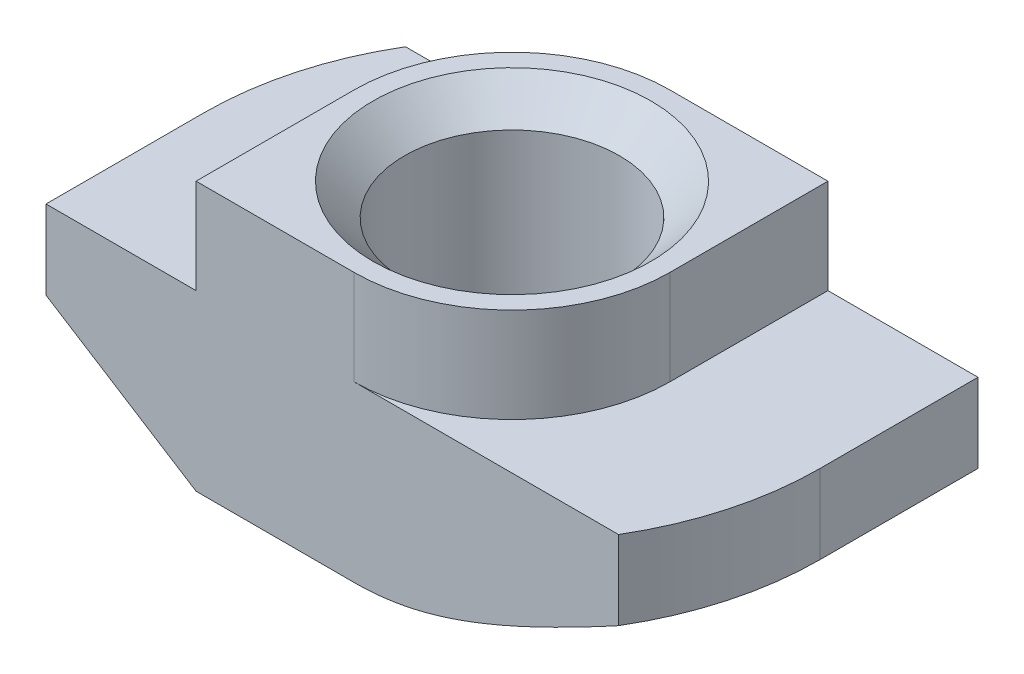
ISO-10303-21;
HEADER;
FILE_DESCRIPTION(('STEP AP214'),'2;1');
FILE_NAME('part.step','',(''),(''),'','','');
FILE_SCHEMA(('AUTOMOTIVE_DESIGN { 1 0 10303 214 1 1 1 1 }'));
ENDSEC;
DATA;
#1=APPLICATION_CONTEXT('core data for automotive mechanical design processes');
#2=APPLICATION_PROTOCOL_DEFINITION('international standard','automotive_design',2000,#1);
#3=PRODUCT_CONTEXT('',#1,'mechanical');
#4=PRODUCT('Part','Part','',(#3));
#5=PRODUCT_RELATED_PRODUCT_CATEGORY('part','',(#4));
#6=PRODUCT_DEFINITION_FORMATION('','',#4);
#7=PRODUCT_DEFINITION_CONTEXT('part definition',#1,'design');
#8=PRODUCT_DEFINITION('design','',#6,#7);
#9=PRODUCT_DEFINITION_SHAPE('','',#8);
#10=(LENGTH_UNIT() NAMED_UNIT(*) SI_UNIT(.MILLI.,.METRE.));
#11=(NAMED_UNIT(*) PLANE_ANGLE_UNIT() SI_UNIT($,.RADIAN.));
#12=(NAMED_UNIT(*) SI_UNIT($,.STERADIAN.) SOLID_ANGLE_UNIT());
#13=UNCERTAINTY_MEASURE_WITH_UNIT(LENGTH_MEASURE(1.E-05),#10,'distance_accuracy_value','');
#14=(GEOMETRIC_REPRESENTATION_CONTEXT(3) GLOBAL_UNCERTAINTY_ASSIGNED_CONTEXT((#13)) GLOBAL_UNIT_ASSIGNED_CONTEXT((#10,
#11,#12)) REPRESENTATION_CONTEXT('',''));
#15=CARTESIAN_POINT('',(0.,0.,0.));
#16=DIRECTION('',(0.,0.,1.));
#17=DIRECTION('',(1.,0.,0.));
#18=AXIS2_PLACEMENT_3D('',#15,#16,#17);
#19=CARTESIAN_POINT('',(-9.75,-3.,5.));
#20=DIRECTION('',(1.,0.,0.));
#21=DIRECTION('',(0.,1.,0.));
#22=AXIS2_PLACEMENT_3D('',#19,#20,#21);
#23=PLANE('',#22);
#24=DIRECTION('',(0.,0.,-1.));
#25=VECTOR('',#24,1.);
#26=CARTESIAN_POINT('',(-9.75,-5.5,5.));
#27=LINE('',#26,#25);
#28=CARTESIAN_POINT('',(-9.75,-5.5,5.));
#29=VERTEX_POINT('',#28);
#30=CARTESIAN_POINT('',(-9.75,-5.5,0.));
#31=VERTEX_POINT('',#30);
#32=EDGE_CURVE('E317',#29,#31,#27,.T.);
#33=ORIENTED_EDGE('',*,*,#32,.F.);
#34=DIRECTION('',(0.,-1.,0.));
#35=VECTOR('',#34,1.);
#36=CARTESIAN_POINT('',(-9.75,-3.,5.));
#37=LINE('',#36,#35);
#38=CARTESIAN_POINT('',(-9.75,-3.,5.));
#39=VERTEX_POINT('',#38);
#40=EDGE_CURVE('E163',#39,#29,#37,.T.);
#41=ORIENTED_EDGE('',*,*,#40,.F.);
#42=DIRECTION('',(0.,0.,-1.));
#43=VECTOR('',#42,1.);
#44=CARTESIAN_POINT('',(-9.75,-3.,5.));
#45=LINE('',#44,#43);
#46=CARTESIAN_POINT('',(-9.75,-3.,0.));
#47=VERTEX_POINT('',#46);
#48=EDGE_CURVE('E45',#39,#47,#45,.T.);
#49=ORIENTED_EDGE('',*,*,#48,.T.);
#50=DIRECTION('',(0.,1.,0.));
#51=VECTOR('',#50,1.);
#52=CARTESIAN_POINT('',(-9.75,-8.5,0.));
#53=LINE('',#52,#51);
#54=EDGE_CURVE('E209',#31,#47,#53,.T.);
#55=ORIENTED_EDGE('',*,*,#54,.F.);
#56=EDGE_LOOP('',(#33,#41,#49,#55));
#57=FACE_BOUND('',#56,.T.);
#58=ADVANCED_FACE('F37',(#57),#23,.F.);
#59=CARTESIAN_POINT('',(-9.75,-8.5,5.));
#60=DIRECTION('',(0.,1.,0.));
#61=DIRECTION('',(0.,0.,1.));
#62=AXIS2_PLACEMENT_3D('',#59,#60,#61);
#63=PLANE('',#62);
#64=CARTESIAN_POINT('',(0.,-8.5,0.));
#65=DIRECTION('',(0.,1.,0.));
#66=DIRECTION('',(0.,0.,1.));
#67=AXIS2_PLACEMENT_3D('',#64,#65,#66);
#68=CIRCLE('',#67,4.4);
#69=CARTESIAN_POINT('',(0.,-8.5,4.4));
#70=VERTEX_POINT('',#69);
#71=EDGE_CURVE('E258',#70,#70,#68,.T.);
#72=ORIENTED_EDGE('',*,*,#71,.T.);
#73=EDGE_LOOP('',(#72));
#74=FACE_BOUND('',#73,.T.);
#75=DIRECTION('',(1.,0.,0.));
#76=VECTOR('',#75,1.);
#77=CARTESIAN_POINT('',(-9.75,-8.5,5.));
#78=LINE('',#77,#76);
#79=CARTESIAN_POINT('',(-5.,-8.5,5.));
#80=VERTEX_POINT('',#79);
#81=CARTESIAN_POINT('',(0.,-8.5,5.));
#82=VERTEX_POINT('',#81);
#83=EDGE_CURVE('E161',#80,#82,#78,.T.);
#84=ORIENTED_EDGE('',*,*,#83,.F.);
#85=DIRECTION('',(0.,0.,-1.));
#86=VECTOR('',#85,1.);
#87=CARTESIAN_POINT('',(-5.,-8.5,5.));
#88=LINE('',#87,#86);
#89=CARTESIAN_POINT('',(-5.,-8.5,0.));
#90=VERTEX_POINT('',#89);
#91=EDGE_CURVE('E146',#80,#90,#88,.T.);
#92=ORIENTED_EDGE('',*,*,#91,.T.);
#93=CARTESIAN_POINT('',(0.,-8.5,0.));
#94=DIRECTION('',(0.,-1.,0.));
#95=DIRECTION('',(-1.,0.,0.));
#96=AXIS2_PLACEMENT_3D('',#93,#94,#95);
#97=CIRCLE('',#96,5.);
#98=CARTESIAN_POINT('',(0.,-8.5,-5.));
#99=VERTEX_POINT('',#98);
#100=EDGE_CURVE('E318',#90,#99,#97,.T.);
#101=ORIENTED_EDGE('',*,*,#100,.T.);
#102=DIRECTION('',(1.,0.,0.));
#103=VECTOR('',#102,1.);
#104=CARTESIAN_POINT('',(-9.75,-8.5,-5.));
#105=LINE('',#104,#103);
#106=CARTESIAN_POINT('',(5.,-8.5,-5.));
#107=VERTEX_POINT('',#106);
#108=EDGE_CURVE('E181',#99,#107,#105,.T.);
#109=ORIENTED_EDGE('',*,*,#108,.T.);
#110=DIRECTION('',(0.,0.,1.));
#111=VECTOR('',#110,1.);
#112=CARTESIAN_POINT('',(5.,-8.5,-9.75));
#113=LINE('',#112,#111);
#114=CARTESIAN_POINT('',(5.,-8.5,0.));
#115=VERTEX_POINT('',#114);
#116=EDGE_CURVE('E52',#107,#115,#113,.T.);
#117=ORIENTED_EDGE('',*,*,#116,.T.);
#118=CARTESIAN_POINT('',(0.,-8.5,0.));
#119=DIRECTION('',(0.,-1.,0.));
#120=DIRECTION('',(1.,0.,0.));
#121=AXIS2_PLACEMENT_3D('',#118,#119,#120);
#122=CIRCLE('',#121,5.);
#123=EDGE_CURVE('E167',#115,#82,#122,.T.);
#124=ORIENTED_EDGE('',*,*,#123,.T.);
#125=EDGE_LOOP('',(#84,#92,#101,#109,#117,#124));
#126=FACE_BOUND('',#125,.T.);
#127=ADVANCED_FACE('F166',(#74,#126),#63,.F.);
#128=CARTESIAN_POINT('',(9.75,-3.,5.));
#129=DIRECTION('',(-1.,0.,0.));
#130=DIRECTION('',(0.,-1.,0.));
#131=AXIS2_PLACEMENT_3D('',#128,#129,#130);
#132=PLANE('',#131);
#133=DIRECTION('',(0.,0.,1.));
#134=VECTOR('',#133,1.);
#135=CARTESIAN_POINT('',(9.75,-5.5,-9.75));
#136=LINE('',#135,#134);
#137=CARTESIAN_POINT('',(9.75,-5.5,-5.));
#138=VERTEX_POINT('',#137);
#139=CARTESIAN_POINT('',(9.75,-5.5,0.));
#140=VERTEX_POINT('',#139);
#141=EDGE_CURVE('E305',#138,#140,#136,.T.);
#142=ORIENTED_EDGE('',*,*,#141,.F.);
#143=DIRECTION('',(0.,1.,0.));
#144=VECTOR('',#143,1.);
#145=CARTESIAN_POINT('',(9.75,-3.,-5.));
#146=LINE('',#145,#144);
#147=CARTESIAN_POINT('',(9.75,-3.,-5.));
#148=VERTEX_POINT('',#147);
#149=EDGE_CURVE('E185',#138,#148,#146,.T.);
#150=ORIENTED_EDGE('',*,*,#149,.T.);
#151=DIRECTION('',(0.,0.,-1.));
#152=VECTOR('',#151,1.);
#153=CARTESIAN_POINT('',(9.75,-3.,5.));
#154=LINE('',#153,#152);
#155=CARTESIAN_POINT('',(9.75,-3.,0.));
#156=VERTEX_POINT('',#155);
#157=EDGE_CURVE('E203',#156,#148,#154,.T.);
#158=ORIENTED_EDGE('',*,*,#157,.F.);
#159=DIRECTION('',(0.,1.,0.));
#160=VECTOR('',#159,1.);
#161=CARTESIAN_POINT('',(9.75,-8.5,0.));
#162=LINE('',#161,#160);
#163=EDGE_CURVE('E220',#140,#156,#162,.T.);
#164=ORIENTED_EDGE('',*,*,#163,.F.);
#165=EDGE_LOOP('',(#142,#150,#158,#164));
#166=FACE_BOUND('',#165,.T.);
#167=ADVANCED_FACE('F304',(#166),#132,.F.);
#168=CARTESIAN_POINT('',(0.,0.,5.));
#169=DIRECTION('',(0.,0.,-1.));
#170=DIRECTION('',(-1.,0.,0.));
#171=AXIS2_PLACEMENT_3D('',#168,#169,#170);
#172=PLANE('',#171);
#173=DIRECTION('',(-0.845488903030971,0.533992991387982,0.));
#174=VECTOR('',#173,1.);
#175=CARTESIAN_POINT('',(-5.,-8.5,5.));
#176=LINE('',#175,#174);
#177=EDGE_CURVE('E149',#80,#29,#176,.T.);
#178=ORIENTED_EDGE('',*,*,#177,.F.);
#179=ORIENTED_EDGE('',*,*,#83,.T.);
#180=CARTESIAN_POINT('',(17.262244143281,-0.307293389432442,5.));
#181=CARTESIAN_POINT('',(16.9181308600236,-0.516038873305145,5.));
#182=CARTESIAN_POINT('',(16.5738102897848,-0.724443579056905,5.));
#183=CARTESIAN_POINT('',(15.8846572648478,-1.14040949764273,5.));
#184=CARTESIAN_POINT('',(15.5398248070583,-1.34797070535434,5.));
#185=CARTESIAN_POINT('',(14.849449183752,-1.76214855860734,5.));
#186=CARTESIAN_POINT('',(14.5039058329425,-1.96876489545256,5.));
#187=CARTESIAN_POINT('',(13.8120865339308,-2.38076637630233,5.));
#188=CARTESIAN_POINT('',(13.4658105873009,-2.58615152294555,5.));
#189=CARTESIAN_POINT('',(12.7701257444387,-2.9967235767826,5.));
#190=CARTESIAN_POINT('',(12.4207110467127,-3.20190066061248,5.));
#191=CARTESIAN_POINT('',(11.7207559725619,-3.61032570435187,5.));
#192=CARTESIAN_POINT('',(11.3702155989535,-3.81357366908299,5.));
#193=CARTESIAN_POINT('',(10.6677796822931,-4.21757158257786,5.));
#194=CARTESIAN_POINT('',(10.3158843909765,-4.41832196857919,5.));
#195=CARTESIAN_POINT('',(9.61028766235045,-4.81662297884814,5.));
#196=CARTESIAN_POINT('',(9.25658624442202,-5.01417363735639,5.));
#197=CARTESIAN_POINT('',(8.67651884482225,-5.33358875947317,5.));
#198=CARTESIAN_POINT('',(8.45085586286926,-5.45672933011883,5.));
#199=CARTESIAN_POINT('',(7.99839816596211,-5.7009118245922,5.));
#200=CARTESIAN_POINT('',(7.7716034613976,-5.82195376764063,5.));
#201=CARTESIAN_POINT('',(7.31656550307167,-6.06150930978857,5.));
#202=CARTESIAN_POINT('',(7.08832171147009,-6.18002188913812,5.));
#203=CARTESIAN_POINT('',(6.63019586788231,-6.4138387855286,5.));
#204=CARTESIAN_POINT('',(6.40031383435597,-6.52914313864854,5.));
#205=CARTESIAN_POINT('',(5.93820478281431,-6.75588727170323,5.));
#206=CARTESIAN_POINT('',(5.7059746936284,-6.86732081363046,5.));
#207=CARTESIAN_POINT('',(5.23907645564551,-7.08502278555658,5.));
#208=CARTESIAN_POINT('',(5.00440814785845,-7.19129087613112,5.));
#209=CARTESIAN_POINT('',(4.53226065346344,-7.39709096715067,5.));
#210=CARTESIAN_POINT('',(4.29478297028451,-7.49662639457186,5.));
#211=CARTESIAN_POINT('',(3.81637192229998,-7.68696585333208,5.));
#212=CARTESIAN_POINT('',(3.5754391700731,-7.77777141099744,5.));
#213=CARTESIAN_POINT('',(3.0666504277393,-7.95599282874955,5.));
#214=CARTESIAN_POINT('',(2.79839541579213,-8.04228449542548,5.));
#215=CARTESIAN_POINT('',(2.2565574894892,-8.19664810960895,5.));
#216=CARTESIAN_POINT('',(1.98297506296302,-8.26472171700009,5.));
#217=CARTESIAN_POINT('',(1.57048018943482,-8.34889725118016,5.));
#218=CARTESIAN_POINT('',(1.43336340824762,-8.37388041638201,5.));
#219=CARTESIAN_POINT('',(1.15813012493196,-8.41748641658561,5.));
#220=CARTESIAN_POINT('',(1.02001377745311,-8.436110214877,5.));
#221=CARTESIAN_POINT('',(0.743060652147379,-8.46647997898083,5.));
#222=CARTESIAN_POINT('',(0.604224087141818,-8.47822787147193,5.));
#223=CARTESIAN_POINT('',(0.326124948003932,-8.49449788273713,5.));
#224=CARTESIAN_POINT('',(0.186862377229114,-8.4990200583135,5.));
#225=CARTESIAN_POINT('',(-0.0922407847681702,-8.50069722270995,5.));
#226=CARTESIAN_POINT('',(-0.232081548334554,-8.49782394939686,5.));
#227=CARTESIAN_POINT('',(-0.511416983097128,-8.48474358023713,5.));
#228=CARTESIAN_POINT('',(-0.650911651522947,-8.47453642587413,5.));
#229=CARTESIAN_POINT('',(-0.929240782372286,-8.44710081868491,5.));
#230=CARTESIAN_POINT('',(-1.06807506182894,-8.42987052298589,5.));
#231=CARTESIAN_POINT('',(-1.34478468003669,-8.38888095808797,5.));
#232=CARTESIAN_POINT('',(-1.48265986658218,-8.36512067578682,5.));
#233=CARTESIAN_POINT('',(-1.89959043169188,-8.28395489226572,5.));
#234=CARTESIAN_POINT('',(-2.17684565694345,-8.21720360210331,5.));
#235=CARTESIAN_POINT('',(-2.72589170638494,-8.06457588389501,5.));
#236=CARTESIAN_POINT('',(-2.99768197912353,-7.97869753625189,5.));
#237=CARTESIAN_POINT('',(-3.51935741319823,-7.79847300649859,5.));
#238=CARTESIAN_POINT('',(-3.76954704201942,-7.70499615425147,5.));
#239=CARTESIAN_POINT('',(-4.26618103118316,-7.50852092270228,5.));
#240=CARTESIAN_POINT('',(-4.51262461455279,-7.40552059867213,5.));
#241=CARTESIAN_POINT('',(-5.00262192827966,-7.19219327582968,5.));
#242=CARTESIAN_POINT('',(-5.24617216747364,-7.08185831308792,5.));
#243=CARTESIAN_POINT('',(-5.73065462411407,-6.85565949095677,5.));
#244=CARTESIAN_POINT('',(-5.97158705304315,-6.73979608232788,5.));
#245=CARTESIAN_POINT('',(-6.43818954732616,-6.5102320811199,5.));
#246=CARTESIAN_POINT('',(-6.66397276848694,-6.39676061738702,5.));
#247=CARTESIAN_POINT('',(-7.11397427522263,-6.16674600104322,5.));
#248=CARTESIAN_POINT('',(-7.33819251414361,-6.05020275734948,5.));
#249=CARTESIAN_POINT('',(-7.78462128962769,-5.81501515861086,5.));
#250=CARTESIAN_POINT('',(-8.00683592168321,-5.69637855963136,5.));
#251=CARTESIAN_POINT('',(-8.45015187326331,-5.45708859393409,5.));
#252=CARTESIAN_POINT('',(-8.67125329033443,-5.3364354080695,5.));
#253=CARTESIAN_POINT('',(-8.89190962188937,-5.21498281447114,5.));
#254=B_SPLINE_CURVE_WITH_KNOTS('',3,(#180,#181,#182,#183,#184,#185,#186,#187,#188,#189,#190,
#191,#192,#193,#194,#195,#196,#197,#198,#199,#200,#201,#202,#203,#204,#205,#206,#207,#208,#209,
#210,#211,#212,#213,#214,#215,#216,#217,#218,#219,#220,#221,#222,#223,#224,#225,#226,#227,#228,
#229,#230,#231,#232,#233,#234,#235,#236,#237,#238,#239,#240,#241,#242,#243,#244,#245,#246,#247,
#248,#249,#250,#251,#252,#253),.UNSPECIFIED.,.F.,.F.,(4,2,2,2,2,2,2,2,2,2,2,2,2,2,2,2,2,2,2,2,2,
2,2,2,2,2,2,2,2,2,2,2,2,2,2,2,4),(0.,1.2074348525902,2.41487702685636,3.6226889318846,
4.83049824742936,6.04609801107066,7.26169473565424,8.47707556989018,9.6924433896013,
10.4636587366001,11.2348670165302,12.0063805610561,12.7778854258001,13.5505808046002,
14.3233268891437,15.0956766332549,15.8678910935751,16.712814547319,17.5576609921784,
17.9756593894318,18.3935944419621,18.8114123299238,19.2292269333493,19.6486406079805,
20.0680576291127,20.4875847762243,20.9071770481351,21.7617047407382,22.6163182326723,
23.4173126374625,24.2184709710381,25.0205138758327,25.8224914976274,26.5805429248652,
27.3386168547938,28.0943078892628,28.8499315110688),.UNSPECIFIED.);
#255=CARTESIAN_POINT('',(8.3703345213916,-5.5,5.));
#256=VERTEX_POINT('',#255);
#257=EDGE_CURVE('E322',#256,#82,#254,.T.);
#258=ORIENTED_EDGE('',*,*,#257,.F.);
#259=DIRECTION('',(0.,1.,0.));
#260=VECTOR('',#259,1.);
#261=CARTESIAN_POINT('',(8.37033452139161,-8.5,5.));
#262=LINE('',#261,#260);
#263=CARTESIAN_POINT('',(8.37033452139161,-3.,5.));
#264=VERTEX_POINT('',#263);
#265=EDGE_CURVE('E223',#256,#264,#262,.T.);
#266=ORIENTED_EDGE('',*,*,#265,.T.);
#267=DIRECTION('',(-1.,0.,0.));
#268=VECTOR('',#267,1.);
#269=CARTESIAN_POINT('',(5.,-3.,5.));
#270=LINE('',#269,#268);
#271=CARTESIAN_POINT('',(0.,-3.,5.));
#272=VERTEX_POINT('',#271);
#273=EDGE_CURVE('E168',#264,#272,#270,.T.);
#274=ORIENTED_EDGE('',*,*,#273,.T.);
#275=DIRECTION('',(0.,1.,0.));
#276=VECTOR('',#275,1.);
#277=CARTESIAN_POINT('',(0.,-10.0710678118655,5.));
#278=LINE('',#277,#276);
#279=CARTESIAN_POINT('',(0.,0.,5.));
#280=VERTEX_POINT('',#279);
#281=EDGE_CURVE('E246',#272,#280,#278,.T.);
#282=ORIENTED_EDGE('',*,*,#281,.T.);
#283=DIRECTION('',(-1.,0.,0.));
#284=VECTOR('',#283,1.);
#285=CARTESIAN_POINT('',(5.,0.,5.));
#286=LINE('',#285,#284);
#287=CARTESIAN_POINT('',(-5.,0.,5.));
#288=VERTEX_POINT('',#287);
#289=EDGE_CURVE('E170',#280,#288,#286,.T.);
#290=ORIENTED_EDGE('',*,*,#289,.T.);
#291=DIRECTION('',(0.,-1.,0.));
#292=VECTOR('',#291,1.);
#293=CARTESIAN_POINT('',(-5.,0.,5.));
#294=LINE('',#293,#292);
#295=CARTESIAN_POINT('',(-5.,-3.,5.));
#296=VERTEX_POINT('',#295);
#297=EDGE_CURVE('E196',#288,#296,#294,.T.);
#298=ORIENTED_EDGE('',*,*,#297,.T.);
#299=DIRECTION('',(-1.,0.,0.));
#300=VECTOR('',#299,1.);
#301=CARTESIAN_POINT('',(-5.,-3.,5.));
#302=LINE('',#301,#300);
#303=EDGE_CURVE('E172',#296,#39,#302,.T.);
#304=ORIENTED_EDGE('',*,*,#303,.T.);
#305=ORIENTED_EDGE('',*,*,#40,.T.);
#306=EDGE_LOOP('',(#178,#179,#258,#266,#274,#282,#290,#298,#304,#305));
#307=FACE_BOUND('',#306,.T.);
#308=ADVANCED_FACE('F159',(#307),#172,.F.);
#309=CARTESIAN_POINT('',(0.,0.,-5.));
#310=DIRECTION('',(0.,0.,-1.));
#311=DIRECTION('',(-1.,0.,0.));
#312=AXIS2_PLACEMENT_3D('',#309,#310,#311);
#313=PLANE('',#312);
#314=ORIENTED_EDGE('',*,*,#108,.F.);
#315=CARTESIAN_POINT('',(8.89190962188937,-5.21498281447114,-5.));
#316=CARTESIAN_POINT('',(8.69807179539359,-5.32168067117576,-5.));
#317=CARTESIAN_POINT('',(8.50388785728022,-5.42775496118508,-5.));
#318=CARTESIAN_POINT('',(8.1146877622672,-5.63838122911741,-5.));
#319=CARTESIAN_POINT('',(7.91967157637704,-5.7429331534413,-5.));
#320=CARTESIAN_POINT('',(7.52839888713611,-5.95038133144811,-5.));
#321=CARTESIAN_POINT('',(7.33214100146388,-6.05327498229202,-5.));
#322=CARTESIAN_POINT('',(6.93849540288173,-6.25688093934329,-5.));
#323=CARTESIAN_POINT('',(6.74110769028751,-6.3575932461601,-5.));
#324=CARTESIAN_POINT('',(6.3357672159849,-6.56100584407135,-5.));
#325=CARTESIAN_POINT('',(6.12775094383909,-6.66357990091405,-5.));
#326=CARTESIAN_POINT('',(5.70998529557087,-6.86514027333031,-5.));
#327=CARTESIAN_POINT('',(5.50023593777036,-6.96412662677306,-5.));
#328=CARTESIAN_POINT('',(5.07876792598832,-7.15757127235479,-5.));
#329=CARTESIAN_POINT('',(4.86705023469105,-7.25203165193533,-5.));
#330=CARTESIAN_POINT('',(4.44118238119509,-7.43528919122207,-5.));
#331=CARTESIAN_POINT('',(4.22703233985032,-7.52408663085993,-5.));
#332=CARTESIAN_POINT('',(3.74385288468483,-7.71506163103555,-5.));
#333=CARTESIAN_POINT('',(3.47404603839998,-7.81530000006557,-5.));
#334=CARTESIAN_POINT('',(2.92922404134082,-8.00085532819617,-5.));
#335=CARTESIAN_POINT('',(2.6542079386462,-8.08616953037964,-5.));
#336=CARTESIAN_POINT('',(2.10323036092006,-8.2355227100339,-5.));
#337=CARTESIAN_POINT('',(1.82736219174236,-8.29989467604697,-5.));
#338=CARTESIAN_POINT('',(1.4101978310497,-8.37787726350092,-5.));
#339=CARTESIAN_POINT('',(1.27061787891269,-8.40077217403349,-5.));
#340=CARTESIAN_POINT('',(0.990522379503271,-8.43978497345868,-5.));
#341=CARTESIAN_POINT('',(0.850006980711086,-8.45590391299746,-5.));
#342=CARTESIAN_POINT('',(0.565328569476554,-8.48115186670237,-5.));
#343=CARTESIAN_POINT('',(0.421151583542625,-8.49012478020239,-5.));
#344=CARTESIAN_POINT('',(0.132539112730267,-8.50020136367205,-5.));
#345=CARTESIAN_POINT('',(-0.0118963351057367,-8.50130608305248,-5.));
#346=CARTESIAN_POINT('',(-0.300615839300795,-8.49561054776519,-5.));
#347=CARTESIAN_POINT('',(-0.444899888884881,-8.48880995327448,-5.));
#348=CARTESIAN_POINT('',(-0.732898629950691,-8.46753431331152,-5.));
#349=CARTESIAN_POINT('',(-0.876613307528637,-8.45305908157811,-5.));
#350=CARTESIAN_POINT('',(-1.16451937665646,-8.41671855383272,-5.));
#351=CARTESIAN_POINT('',(-1.30870177468433,-8.39478264310604,-5.));
#352=CARTESIAN_POINT('',(-1.59588471177897,-8.34419166821339,-5.));
#353=CARTESIAN_POINT('',(-1.73888515141359,-8.31553604458982,-5.));
#354=CARTESIAN_POINT('',(-2.02358463369644,-8.25221795864572,-5.));
#355=CARTESIAN_POINT('',(-2.16528327980946,-8.21755372603012,-5.));
#356=CARTESIAN_POINT('',(-2.44727277130383,-8.14295776240236,-5.));
#357=CARTESIAN_POINT('',(-2.58756365220683,-8.10302616466134,-5.));
#358=CARTESIAN_POINT('',(-2.927338724847,-8.0002726410662,-5.));
#359=CARTESIAN_POINT('',(-3.12609221591402,-7.93503691060338,-5.));
#360=CARTESIAN_POINT('',(-3.52096210701494,-7.79698222477459,-5.));
#361=CARTESIAN_POINT('',(-3.71707797307315,-7.72416175924735,-5.));
#362=CARTESIAN_POINT('',(-4.10708618196062,-7.57237690861237,-5.));
#363=CARTESIAN_POINT('',(-4.3009766096039,-7.49340762920191,-5.));
#364=CARTESIAN_POINT('',(-4.6866661338769,-7.33057513990394,-5.));
#365=CARTESIAN_POINT('',(-4.87846536352017,-7.24671224346253,-5.));
#366=CARTESIAN_POINT('',(-5.2607772593493,-7.07480224612794,-5.));
#367=CARTESIAN_POINT('',(-5.4512852403128,-6.98674476181852,-5.));
#368=CARTESIAN_POINT('',(-5.83076905474579,-6.80738201092531,-5.));
#369=CARTESIAN_POINT('',(-6.01974483535833,-6.71607663287805,-5.));
#370=CARTESIAN_POINT('',(-6.58454713908627,-6.43827749032946,-5.));
#371=CARTESIAN_POINT('',(-6.95842335536811,-6.24782078764797,-5.));
#372=CARTESIAN_POINT('',(-7.70515742488139,-5.85818779711648,-5.));
#373=CARTESIAN_POINT('',(-8.07798641398966,-5.65895665273319,-5.));
#374=CARTESIAN_POINT('',(-8.82080321981212,-5.2552033688582,-5.));
#375=CARTESIAN_POINT('',(-9.19079078800562,-5.05068077324098,-5.));
#376=CARTESIAN_POINT('',(-9.92800640083409,-4.63809357113866,-5.));
#377=CARTESIAN_POINT('',(-10.29523790102,-4.43003512218061,-5.));
#378=CARTESIAN_POINT('',(-11.0280229788243,-4.01101145190697,-5.));
#379=CARTESIAN_POINT('',(-11.3935766017493,-3.80004630970179,-5.));
#380=CARTESIAN_POINT('',(-12.2228494781368,-3.31806355804453,-5.));
#381=CARTESIAN_POINT('',(-12.6861650743858,-3.04635210462268,-5.));
#382=CARTESIAN_POINT('',(-13.6114053897672,-2.50014341269301,-5.));
#383=CARTESIAN_POINT('',(-14.0733294596121,-2.22564507603178,-5.));
#384=CARTESIAN_POINT('',(-14.9903643529218,-1.67796879648898,-5.));
#385=CARTESIAN_POINT('',(-15.4454897918055,-1.40481530279485,-5.));
#386=CARTESIAN_POINT('',(-16.3546077462169,-0.857062812640609,-5.));
#387=CARTESIAN_POINT('',(-16.8086006597524,-0.582464476988671,-5.));
#388=CARTESIAN_POINT('',(-17.262244143281,-0.307293389432445,-5.));
#389=B_SPLINE_CURVE_WITH_KNOTS('',3,(#315,#316,#317,#318,#319,#320,#321,#322,#323,#324,#325,
#326,#327,#328,#329,#330,#331,#332,#333,#334,#335,#336,#337,#338,#339,#340,#341,#342,#343,#344,
#345,#346,#347,#348,#349,#350,#351,#352,#353,#354,#355,#356,#357,#358,#359,#360,#361,#362,#363,
#364,#365,#366,#367,#368,#369,#370,#371,#372,#373,#374,#375,#376,#377,#378,#379,#380,#381,#382,
#383,#384,#385,#386,#387,#388),.UNSPECIFIED.,.F.,.F.,(4,2,2,2,2,2,2,2,2,2,2,2,2,2,2,2,2,2,2,2,2,
2,2,2,2,2,2,2,2,2,2,2,2,2,2,2,4),(0.,0.663793087551966,1.32760948954786,1.99238242300439,
2.65715517073158,3.35292173371489,4.04868095055264,4.74411612233015,5.43951689051758,
6.30265939462683,7.16596117765935,8.01477619153837,8.43897242720581,8.86310286497019,
9.29626188046449,9.72936312282145,10.1624829834396,10.5956133562287,11.0329629501478,
11.4703489690564,11.9078640731688,12.3453681097069,12.9727207083369,13.6001984558662,
14.2281808687188,14.8561231020818,15.4857099520211,16.115318429447,17.3739591861229,
18.6420768889435,19.9103042707088,21.1765125465911,22.4426864283525,24.054007297902,
25.665989850327,27.2583959045239,28.8501279099315),.UNSPECIFIED.);
#390=CARTESIAN_POINT('',(-8.3703345213916,-5.5,-5.));
#391=VERTEX_POINT('',#390);
#392=EDGE_CURVE('E227',#99,#391,#389,.T.);
#393=ORIENTED_EDGE('',*,*,#392,.T.);
#394=DIRECTION('',(0.,1.,0.));
#395=VECTOR('',#394,1.);
#396=CARTESIAN_POINT('',(-8.3703345213916,-8.5,-5.));
#397=LINE('',#396,#395);
#398=CARTESIAN_POINT('',(-8.3703345213916,-3.,-5.));
#399=VERTEX_POINT('',#398);
#400=EDGE_CURVE('E219',#391,#399,#397,.T.);
#401=ORIENTED_EDGE('',*,*,#400,.T.);
#402=DIRECTION('',(-1.,0.,0.));
#403=VECTOR('',#402,1.);
#404=CARTESIAN_POINT('',(-5.,-3.,-5.));
#405=LINE('',#404,#403);
#406=CARTESIAN_POINT('',(0.,-3.,-5.));
#407=VERTEX_POINT('',#406);
#408=EDGE_CURVE('E178',#407,#399,#405,.T.);
#409=ORIENTED_EDGE('',*,*,#408,.F.);
#410=DIRECTION('',(0.,1.,0.));
#411=VECTOR('',#410,1.);
#412=CARTESIAN_POINT('',(0.,-10.0710678118655,-5.));
#413=LINE('',#412,#411);
#414=CARTESIAN_POINT('',(0.,0.,-5.));
#415=VERTEX_POINT('',#414);
#416=EDGE_CURVE('E255',#407,#415,#413,.T.);
#417=ORIENTED_EDGE('',*,*,#416,.T.);
#418=DIRECTION('',(-1.,0.,0.));
#419=VECTOR('',#418,1.);
#420=CARTESIAN_POINT('',(5.,0.,-5.));
#421=LINE('',#420,#419);
#422=CARTESIAN_POINT('',(5.,0.,-5.));
#423=VERTEX_POINT('',#422);
#424=EDGE_CURVE('E193',#423,#415,#421,.T.);
#425=ORIENTED_EDGE('',*,*,#424,.F.);
#426=DIRECTION('',(0.,1.,0.));
#427=VECTOR('',#426,1.);
#428=CARTESIAN_POINT('',(5.,0.,-5.));
#429=LINE('',#428,#427);
#430=CARTESIAN_POINT('',(5.,-3.,-5.));
#431=VERTEX_POINT('',#430);
#432=EDGE_CURVE('E190',#431,#423,#429,.T.);
#433=ORIENTED_EDGE('',*,*,#432,.F.);
#434=DIRECTION('',(-1.,0.,0.));
#435=VECTOR('',#434,1.);
#436=CARTESIAN_POINT('',(5.,-3.,-5.));
#437=LINE('',#436,#435);
#438=EDGE_CURVE('E187',#148,#431,#437,.T.);
#439=ORIENTED_EDGE('',*,*,#438,.F.);
#440=ORIENTED_EDGE('',*,*,#149,.F.);
#441=DIRECTION('',(-0.845488903030971,-0.533992991387982,0.));
#442=VECTOR('',#441,1.);
#443=CARTESIAN_POINT('',(5.26336633663366,-8.33366336633664,-5.));
#444=LINE('',#443,#442);
#445=EDGE_CURVE('E314',#138,#107,#444,.T.);
#446=ORIENTED_EDGE('',*,*,#445,.T.);
#447=EDGE_LOOP('',(#314,#393,#401,#409,#417,#425,#433,#439,#440,#446));
#448=FACE_BOUND('',#447,.T.);
#449=ADVANCED_FACE('F283',(#448),#313,.T.);
#450=CARTESIAN_POINT('',(0.,-8.5,0.));
#451=DIRECTION('',(0.,1.,0.));
#452=DIRECTION('',(-1.,0.,0.));
#453=AXIS2_PLACEMENT_3D('',#450,#451,#452);
#454=CYLINDRICAL_SURFACE('',#453,9.75);
#455=CARTESIAN_POINT('',(0.,-5.5,0.));
#456=DIRECTION('',(0.,-1.,0.));
#457=DIRECTION('',(-1.,0.,0.));
#458=AXIS2_PLACEMENT_3D('',#455,#456,#457);
#459=CIRCLE('',#458,9.75);
#460=EDGE_CURVE('E60',#31,#391,#459,.T.);
#461=ORIENTED_EDGE('',*,*,#460,.F.);
#462=ORIENTED_EDGE('',*,*,#54,.T.);
#463=CARTESIAN_POINT('',(0.,-3.,0.));
#464=DIRECTION('',(0.,-1.,0.));
#465=DIRECTION('',(-1.,0.,0.));
#466=AXIS2_PLACEMENT_3D('',#463,#464,#465);
#467=CIRCLE('',#466,9.75);
#468=EDGE_CURVE('E215',#47,#399,#467,.T.);
#469=ORIENTED_EDGE('',*,*,#468,.T.);
#470=ORIENTED_EDGE('',*,*,#400,.F.);
#471=EDGE_LOOP('',(#461,#462,#469,#470));
#472=FACE_BOUND('',#471,.T.);
#473=ADVANCED_FACE('F345',(#472),#454,.T.);
#474=CARTESIAN_POINT('',(0.,-8.5,0.));
#475=DIRECTION('',(0.,1.,0.));
#476=DIRECTION('',(-1.,0.,0.));
#477=AXIS2_PLACEMENT_3D('',#474,#475,#476);
#478=CYLINDRICAL_SURFACE('',#477,9.75);
#479=CARTESIAN_POINT('',(0.,-5.5,0.));
#480=DIRECTION('',(0.,-1.,0.));
#481=DIRECTION('',(1.,0.,0.));
#482=AXIS2_PLACEMENT_3D('',#479,#480,#481);
#483=CIRCLE('',#482,9.75);
#484=EDGE_CURVE('E310',#140,#256,#483,.T.);
#485=ORIENTED_EDGE('',*,*,#484,.F.);
#486=ORIENTED_EDGE('',*,*,#163,.T.);
#487=CARTESIAN_POINT('',(0.,-3.,0.));
#488=DIRECTION('',(0.,-1.,0.));
#489=DIRECTION('',(1.,0.,0.));
#490=AXIS2_PLACEMENT_3D('',#487,#488,#489);
#491=CIRCLE('',#490,9.75);
#492=EDGE_CURVE('E237',#156,#264,#491,.T.);
#493=ORIENTED_EDGE('',*,*,#492,.T.);
#494=ORIENTED_EDGE('',*,*,#265,.F.);
#495=EDGE_LOOP('',(#485,#486,#493,#494));
#496=FACE_BOUND('',#495,.T.);
#497=ADVANCED_FACE('F348',(#496),#478,.T.);
#498=CARTESIAN_POINT('',(5.,0.,5.));
#499=DIRECTION('',(0.,-1.,0.));
#500=DIRECTION('',(0.,0.,-1.));
#501=AXIS2_PLACEMENT_3D('',#498,#499,#500);
#502=PLANE('',#501);
#503=ORIENTED_EDGE('',*,*,#289,.F.);
#504=CARTESIAN_POINT('',(0.,0.,0.));
#505=DIRECTION('',(0.,-1.,0.));
#506=DIRECTION('',(0.,0.,-1.));
#507=AXIS2_PLACEMENT_3D('',#504,#505,#506);
#508=CIRCLE('',#507,5.);
#509=CARTESIAN_POINT('',(5.,0.,0.));
#510=VERTEX_POINT('',#509);
#511=EDGE_CURVE('E235',#510,#280,#508,.T.);
#512=ORIENTED_EDGE('',*,*,#511,.F.);
#513=DIRECTION('',(0.,0.,-1.));
#514=VECTOR('',#513,1.);
#515=CARTESIAN_POINT('',(5.,0.,5.));
#516=LINE('',#515,#514);
#517=EDGE_CURVE('E199',#510,#423,#516,.T.);
#518=ORIENTED_EDGE('',*,*,#517,.T.);
#519=ORIENTED_EDGE('',*,*,#424,.T.);
#520=CARTESIAN_POINT('',(0.,0.,0.));
#521=DIRECTION('',(0.,-1.,0.));
#522=DIRECTION('',(0.,0.,-1.));
#523=AXIS2_PLACEMENT_3D('',#520,#521,#522);
#524=CIRCLE('',#523,5.);
#525=CARTESIAN_POINT('',(-5.,0.,0.));
#526=VERTEX_POINT('',#525);
#527=EDGE_CURVE('E250',#526,#415,#524,.T.);
#528=ORIENTED_EDGE('',*,*,#527,.F.);
#529=DIRECTION('',(0.,0.,-1.));
#530=VECTOR('',#529,1.);
#531=CARTESIAN_POINT('',(-5.,0.,5.));
#532=LINE('',#531,#530);
#533=EDGE_CURVE('E177',#288,#526,#532,.T.);
#534=ORIENTED_EDGE('',*,*,#533,.F.);
#535=EDGE_LOOP('',(#503,#512,#518,#519,#528,#534));
#536=FACE_BOUND('',#535,.T.);
#537=CARTESIAN_POINT('',(0.,0.,0.));
#538=DIRECTION('',(0.,1.,0.));
#539=DIRECTION('',(0.,0.,1.));
#540=AXIS2_PLACEMENT_3D('',#537,#538,#539);
#541=CIRCLE('',#540,4.4);
#542=CARTESIAN_POINT('',(0.,0.,4.4));
#543=VERTEX_POINT('',#542);
#544=EDGE_CURVE('E262',#543,#543,#541,.T.);
#545=ORIENTED_EDGE('',*,*,#544,.F.);
#546=EDGE_LOOP('',(#545));
#547=FACE_BOUND('',#546,.T.);
#548=ADVANCED_FACE('F286',(#536,#547),#502,.F.);
#549=CARTESIAN_POINT('',(-5.,0.,5.));
#550=DIRECTION('',(1.,0.,0.));
#551=DIRECTION('',(0.,0.,-1.));
#552=AXIS2_PLACEMENT_3D('',#549,#550,#551);
#553=PLANE('',#552);
#554=ORIENTED_EDGE('',*,*,#533,.T.);
#555=DIRECTION('',(0.,1.,0.));
#556=VECTOR('',#555,1.);
#557=CARTESIAN_POINT('',(-5.,-10.0710678118655,0.));
#558=LINE('',#557,#556);
#559=CARTESIAN_POINT('',(-5.,-3.,0.));
#560=VERTEX_POINT('',#559);
#561=EDGE_CURVE('E252',#560,#526,#558,.T.);
#562=ORIENTED_EDGE('',*,*,#561,.F.);
#563=DIRECTION('',(0.,0.,-1.));
#564=VECTOR('',#563,1.);
#565=CARTESIAN_POINT('',(-5.,-3.,5.));
#566=LINE('',#565,#564);
#567=EDGE_CURVE('E11',#296,#560,#566,.T.);
#568=ORIENTED_EDGE('',*,*,#567,.F.);
#569=ORIENTED_EDGE('',*,*,#297,.F.);
#570=EDGE_LOOP('',(#554,#562,#568,#569));
#571=FACE_BOUND('',#570,.T.);
#572=ADVANCED_FACE('F39',(#571),#553,.F.);
#573=CARTESIAN_POINT('',(-5.,-3.,5.));
#574=DIRECTION('',(0.,-1.,0.));
#575=DIRECTION('',(1.,0.,0.));
#576=AXIS2_PLACEMENT_3D('',#573,#574,#575);
#577=PLANE('',#576);
#578=ORIENTED_EDGE('',*,*,#408,.T.);
#579=ORIENTED_EDGE('',*,*,#468,.F.);
#580=ORIENTED_EDGE('',*,*,#48,.F.);
#581=ORIENTED_EDGE('',*,*,#303,.F.);
#582=ORIENTED_EDGE('',*,*,#567,.T.);
#583=CARTESIAN_POINT('',(0.,-3.,0.));
#584=DIRECTION('',(0.,-1.,0.));
#585=DIRECTION('',(1.,0.,0.));
#586=AXIS2_PLACEMENT_3D('',#583,#584,#585);
#587=CIRCLE('',#586,5.);
#588=EDGE_CURVE('E253',#560,#407,#587,.T.);
#589=ORIENTED_EDGE('',*,*,#588,.T.);
#590=EDGE_LOOP('',(#578,#579,#580,#581,#582,#589));
#591=FACE_BOUND('',#590,.T.);
#592=ADVANCED_FACE('F212',(#591),#577,.F.);
#593=CARTESIAN_POINT('',(5.,-3.,5.));
#594=DIRECTION('',(0.,-1.,0.));
#595=DIRECTION('',(1.,0.,0.));
#596=AXIS2_PLACEMENT_3D('',#593,#594,#595);
#597=PLANE('',#596);
#598=ORIENTED_EDGE('',*,*,#273,.F.);
#599=ORIENTED_EDGE('',*,*,#492,.F.);
#600=ORIENTED_EDGE('',*,*,#157,.T.);
#601=ORIENTED_EDGE('',*,*,#438,.T.);
#602=DIRECTION('',(0.,0.,-1.));
#603=VECTOR('',#602,1.);
#604=CARTESIAN_POINT('',(5.,-3.,5.));
#605=LINE('',#604,#603);
#606=CARTESIAN_POINT('',(5.,-3.,0.));
#607=VERTEX_POINT('',#606);
#608=EDGE_CURVE('E201',#607,#431,#605,.T.);
#609=ORIENTED_EDGE('',*,*,#608,.F.);
#610=CARTESIAN_POINT('',(0.,-3.,0.));
#611=DIRECTION('',(0.,-1.,0.));
#612=DIRECTION('',(1.,0.,0.));
#613=AXIS2_PLACEMENT_3D('',#610,#611,#612);
#614=CIRCLE('',#613,5.);
#615=EDGE_CURVE('E243',#607,#272,#614,.T.);
#616=ORIENTED_EDGE('',*,*,#615,.T.);
#617=EDGE_LOOP('',(#598,#599,#600,#601,#609,#616));
#618=FACE_BOUND('',#617,.T.);
#619=ADVANCED_FACE('F298',(#618),#597,.F.);
#620=CARTESIAN_POINT('',(5.,0.,5.));
#621=DIRECTION('',(-1.,0.,0.));
#622=DIRECTION('',(0.,0.,1.));
#623=AXIS2_PLACEMENT_3D('',#620,#621,#622);
#624=PLANE('',#623);
#625=ORIENTED_EDGE('',*,*,#517,.F.);
#626=DIRECTION('',(0.,1.,0.));
#627=VECTOR('',#626,1.);
#628=CARTESIAN_POINT('',(5.,-10.0710678118655,0.));
#629=LINE('',#628,#627);
#630=EDGE_CURVE('E242',#607,#510,#629,.T.);
#631=ORIENTED_EDGE('',*,*,#630,.F.);
#632=ORIENTED_EDGE('',*,*,#608,.T.);
#633=ORIENTED_EDGE('',*,*,#432,.T.);
#634=EDGE_LOOP('',(#625,#631,#632,#633));
#635=FACE_BOUND('',#634,.T.);
#636=ADVANCED_FACE('F292',(#635),#624,.F.);
#637=CARTESIAN_POINT('',(0.,-7.5,0.));
#638=DIRECTION('',(0.,-1.,0.));
#639=DIRECTION('',(0.,0.,-1.));
#640=AXIS2_PLACEMENT_3D('',#637,#638,#639);
#641=CONICAL_SURFACE('',#640,3.4,0.785398163397446);
#642=ORIENTED_EDGE('',*,*,#71,.F.);
#643=EDGE_LOOP('',(#642));
#644=FACE_BOUND('',#643,.T.);
#645=CARTESIAN_POINT('',(0.,-7.5,0.));
#646=DIRECTION('',(0.,1.,0.));
#647=DIRECTION('',(0.,0.,1.));
#648=AXIS2_PLACEMENT_3D('',#645,#646,#647);
#649=CIRCLE('',#648,3.4);
#650=CARTESIAN_POINT('',(0.,-7.5,3.4));
#651=VERTEX_POINT('',#650);
#652=EDGE_CURVE('E182',#651,#651,#649,.T.);
#653=ORIENTED_EDGE('',*,*,#652,.T.);
#654=EDGE_LOOP('',(#653));
#655=FACE_BOUND('',#654,.T.);
#656=ADVANCED_FACE('F363',(#644,#655),#641,.F.);
#657=CARTESIAN_POINT('',(0.,0.,0.));
#658=DIRECTION('',(0.,1.,0.));
#659=DIRECTION('',(0.,0.,1.));
#660=AXIS2_PLACEMENT_3D('',#657,#658,#659);
#661=CYLINDRICAL_SURFACE('',#660,3.4);
#662=ORIENTED_EDGE('',*,*,#652,.F.);
#663=EDGE_LOOP('',(#662));
#664=FACE_BOUND('',#663,.T.);
#665=CARTESIAN_POINT('',(0.,-0.999999999999999,0.));
#666=DIRECTION('',(0.,1.,0.));
#667=DIRECTION('',(0.,0.,1.));
#668=AXIS2_PLACEMENT_3D('',#665,#666,#667);
#669=CIRCLE('',#668,3.4);
#670=CARTESIAN_POINT('',(0.,-0.999999999999999,3.4));
#671=VERTEX_POINT('',#670);
#672=EDGE_CURVE('E265',#671,#671,#669,.T.);
#673=ORIENTED_EDGE('',*,*,#672,.T.);
#674=EDGE_LOOP('',(#673));
#675=FACE_BOUND('',#674,.T.);
#676=ADVANCED_FACE('F360',(#664,#675),#661,.F.);
#677=CARTESIAN_POINT('',(0.,0.,0.));
#678=DIRECTION('',(0.,1.,0.));
#679=DIRECTION('',(0.,0.,1.));
#680=AXIS2_PLACEMENT_3D('',#677,#678,#679);
#681=CONICAL_SURFACE('',#680,4.4,0.785398163397449);
#682=ORIENTED_EDGE('',*,*,#672,.F.);
#683=EDGE_LOOP('',(#682));
#684=FACE_BOUND('',#683,.T.);
#685=ORIENTED_EDGE('',*,*,#544,.T.);
#686=EDGE_LOOP('',(#685));
#687=FACE_BOUND('',#686,.T.);
#688=ADVANCED_FACE('F357',(#684,#687),#681,.F.);
#689=CARTESIAN_POINT('',(0.,-10.0710678118655,0.));
#690=DIRECTION('',(0.,1.,0.));
#691=DIRECTION('',(0.,0.,1.));
#692=AXIS2_PLACEMENT_3D('',#689,#690,#691);
#693=CYLINDRICAL_SURFACE('',#692,5.);
#694=ORIENTED_EDGE('',*,*,#561,.T.);
#695=ORIENTED_EDGE('',*,*,#527,.T.);
#696=ORIENTED_EDGE('',*,*,#416,.F.);
#697=ORIENTED_EDGE('',*,*,#588,.F.);
#698=EDGE_LOOP('',(#694,#695,#696,#697));
#699=FACE_BOUND('',#698,.T.);
#700=ADVANCED_FACE('F278',(#699),#693,.T.);
#701=CARTESIAN_POINT('',(0.,-10.0710678118655,0.));
#702=DIRECTION('',(0.,1.,0.));
#703=DIRECTION('',(0.,0.,1.));
#704=AXIS2_PLACEMENT_3D('',#701,#702,#703);
#705=CYLINDRICAL_SURFACE('',#704,5.);
#706=ORIENTED_EDGE('',*,*,#630,.T.);
#707=ORIENTED_EDGE('',*,*,#511,.T.);
#708=ORIENTED_EDGE('',*,*,#281,.F.);
#709=ORIENTED_EDGE('',*,*,#615,.F.);
#710=EDGE_LOOP('',(#706,#707,#708,#709));
#711=FACE_BOUND('',#710,.T.);
#712=ADVANCED_FACE('F340',(#711),#705,.T.);
#713=CARTESIAN_POINT('',(5.,-8.5,-9.75));
#714=DIRECTION('',(0.533992991387982,-0.845488903030971,0.));
#715=DIRECTION('',(0.845488903030971,0.533992991387982,0.));
#716=AXIS2_PLACEMENT_3D('',#713,#714,#715);
#717=PLANE('',#716);
#718=ORIENTED_EDGE('',*,*,#141,.T.);
#719=DIRECTION('',(0.845488903030971,0.533992991387982,0.));
#720=VECTOR('',#719,1.);
#721=CARTESIAN_POINT('',(5.,-8.5,0.));
#722=LINE('',#721,#720);
#723=EDGE_CURVE('E307',#115,#140,#722,.T.);
#724=ORIENTED_EDGE('',*,*,#723,.F.);
#725=ORIENTED_EDGE('',*,*,#116,.F.);
#726=ORIENTED_EDGE('',*,*,#445,.F.);
#727=EDGE_LOOP('',(#718,#724,#725,#726));
#728=FACE_BOUND('',#727,.T.);
#729=ADVANCED_FACE('F335',(#728),#717,.T.);
#730=CARTESIAN_POINT('',(0.,-8.5,0.));
#731=DIRECTION('',(0.,1.,0.));
#732=DIRECTION('',(0.,0.,1.));
#733=AXIS2_PLACEMENT_3D('',#730,#731,#732);
#734=CONICAL_SURFACE('',#733,5.,1.00748006530293);
#735=ORIENTED_EDGE('',*,*,#257,.T.);
#736=ORIENTED_EDGE('',*,*,#123,.F.);
#737=ORIENTED_EDGE('',*,*,#723,.T.);
#738=ORIENTED_EDGE('',*,*,#484,.T.);
#739=EDGE_LOOP('',(#735,#736,#737,#738));
#740=FACE_BOUND('',#739,.T.);
#741=ADVANCED_FACE('F331',(#740),#734,.T.);
#742=CARTESIAN_POINT('',(-5.,-8.5,5.));
#743=DIRECTION('',(-0.533992991387982,-0.845488903030971,0.));
#744=DIRECTION('',(0.845488903030971,-0.533992991387982,0.));
#745=AXIS2_PLACEMENT_3D('',#742,#743,#744);
#746=PLANE('',#745);
#747=ORIENTED_EDGE('',*,*,#32,.T.);
#748=DIRECTION('',(-0.845488903030971,0.533992991387982,0.));
#749=VECTOR('',#748,1.);
#750=CARTESIAN_POINT('',(-5.,-8.5,0.));
#751=LINE('',#750,#749);
#752=EDGE_CURVE('E151',#90,#31,#751,.T.);
#753=ORIENTED_EDGE('',*,*,#752,.F.);
#754=ORIENTED_EDGE('',*,*,#91,.F.);
#755=ORIENTED_EDGE('',*,*,#177,.T.);
#756=EDGE_LOOP('',(#747,#753,#754,#755));
#757=FACE_BOUND('',#756,.T.);
#758=ADVANCED_FACE('F148',(#757),#746,.T.);
#759=CARTESIAN_POINT('',(0.,-8.5,0.));
#760=DIRECTION('',(0.,1.,0.));
#761=DIRECTION('',(0.,0.,1.));
#762=AXIS2_PLACEMENT_3D('',#759,#760,#761);
#763=CONICAL_SURFACE('',#762,5.,1.00748006530293);
#764=ORIENTED_EDGE('',*,*,#100,.F.);
#765=ORIENTED_EDGE('',*,*,#752,.T.);
#766=ORIENTED_EDGE('',*,*,#460,.T.);
#767=ORIENTED_EDGE('',*,*,#392,.F.);
#768=EDGE_LOOP('',(#764,#765,#766,#767));
#769=FACE_BOUND('',#768,.T.);
#770=ADVANCED_FACE('F337',(#769),#763,.T.);
#771=CLOSED_SHELL('',(#58,#127,#167,#308,#449,#473,#497,#548,#572,#592,#619,#636,#656,#676,#688,
#700,#712,#729,#741,#758,#770));
#772=MANIFOLD_SOLID_BREP('B2',#771);
#773=ADVANCED_BREP_SHAPE_REPRESENTATION('',(#18,#772),#14);
#774=SHAPE_DEFINITION_REPRESENTATION(#9,#773);
ENDSEC;
END-ISO-10303-21;
